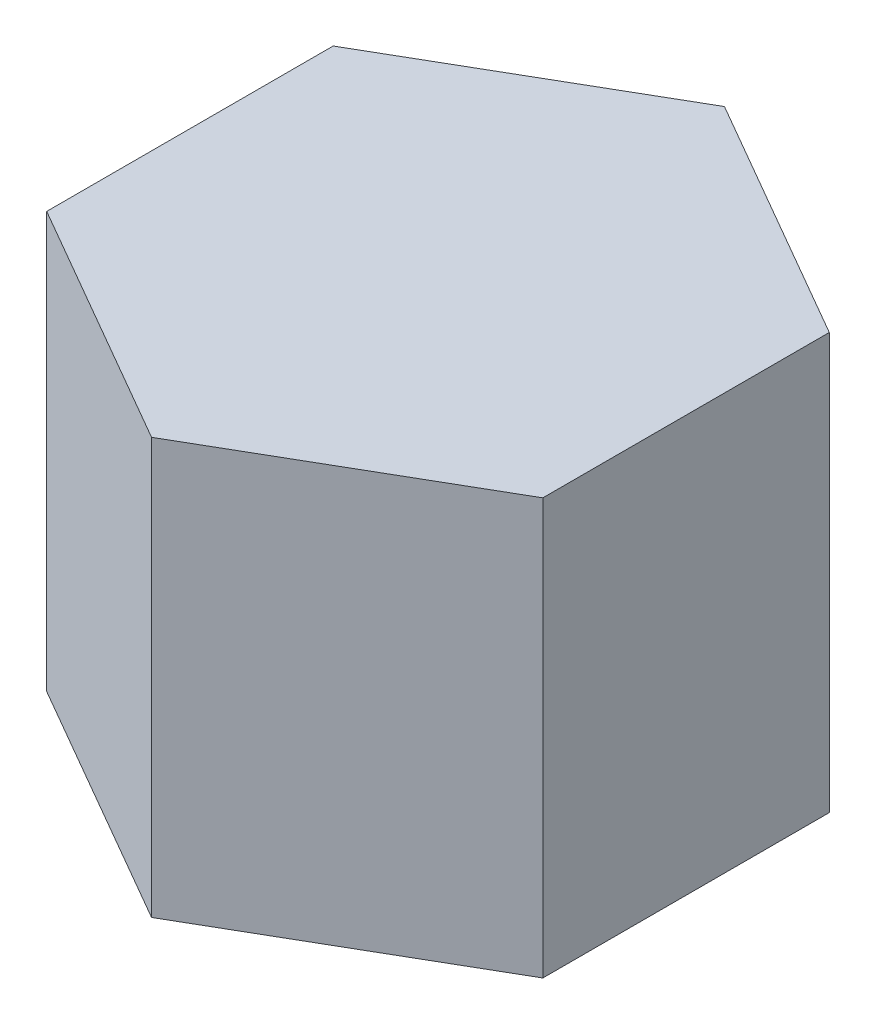
ISO-10303-21;
HEADER;
FILE_DESCRIPTION(('STEP AP214'),'2;1');
FILE_NAME('part.step','',(''),(''),'','','');
FILE_SCHEMA(('AUTOMOTIVE_DESIGN { 1 0 10303 214 1 1 1 1 }'));
ENDSEC;
DATA;
#1=APPLICATION_CONTEXT('core data for automotive mechanical design processes');
#2=APPLICATION_PROTOCOL_DEFINITION('international standard','automotive_design',2000,#1);
#3=PRODUCT_CONTEXT('',#1,'mechanical');
#4=PRODUCT('Part','Part','',(#3));
#5=PRODUCT_RELATED_PRODUCT_CATEGORY('part','',(#4));
#6=PRODUCT_DEFINITION_FORMATION('','',#4);
#7=PRODUCT_DEFINITION_CONTEXT('part definition',#1,'design');
#8=PRODUCT_DEFINITION('design','',#6,#7);
#9=PRODUCT_DEFINITION_SHAPE('','',#8);
#10=(LENGTH_UNIT() NAMED_UNIT(*) SI_UNIT(.MILLI.,.METRE.));
#11=(NAMED_UNIT(*) PLANE_ANGLE_UNIT() SI_UNIT($,.RADIAN.));
#12=(NAMED_UNIT(*) SI_UNIT($,.STERADIAN.) SOLID_ANGLE_UNIT());
#13=UNCERTAINTY_MEASURE_WITH_UNIT(LENGTH_MEASURE(1.E-05),#10,'distance_accuracy_value','');
#14=(GEOMETRIC_REPRESENTATION_CONTEXT(3) GLOBAL_UNCERTAINTY_ASSIGNED_CONTEXT((#13)) GLOBAL_UNIT_ASSIGNED_CONTEXT((#10,
#11,#12)) REPRESENTATION_CONTEXT('',''));
#15=CARTESIAN_POINT('',(0.,0.,0.));
#16=DIRECTION('',(0.,0.,1.));
#17=DIRECTION('',(1.,0.,0.));
#18=AXIS2_PLACEMENT_3D('',#15,#16,#17);
#19=CARTESIAN_POINT('',(202.642660308706,-148.537700895744,288.042869605357));
#20=DIRECTION('',(-0.499999999999943,0.,-0.866025403784472));
#21=DIRECTION('',(-0.866025403784472,0.,0.499999999999943));
#22=AXIS2_PLACEMENT_3D('',#19,#20,#21);
#23=PLANE('',#22);
#24=CARTESIAN_POINT('',(202.339551417382,-149.045793579175,288.217869605357));
#25=DIRECTION('',(0.866025403784471,0.,-0.499999999999943));
#26=VECTOR('',#25,1.);
#27=LINE('',#24,#26);
#28=CARTESIAN_POINT('',(202.339551417382,-149.045793579175,288.217869605357));
#29=VERTEX_POINT('',#28);
#30=CARTESIAN_POINT('',(202.642660308706,-149.045793579175,288.042869605357));
#31=VERTEX_POINT('',#30);
#32=EDGE_CURVE('E170',#29,#31,#27,.T.);
#33=ORIENTED_EDGE('',*,*,#32,.T.);
#34=CARTESIAN_POINT('',(202.642660308706,-148.537700895744,288.042869605357));
#35=DIRECTION('',(0.,-1.,0.));
#36=VECTOR('',#35,1.);
#37=LINE('',#34,#36);
#38=CARTESIAN_POINT('',(202.642660308706,-148.537700895744,288.042869605357));
#39=VERTEX_POINT('',#38);
#40=EDGE_CURVE('E35',#39,#31,#37,.T.);
#41=ORIENTED_EDGE('',*,*,#40,.F.);
#42=CARTESIAN_POINT('',(202.339551417382,-148.537700895744,288.217869605357));
#43=DIRECTION('',(0.866025403784471,0.,-0.499999999999943));
#44=VECTOR('',#43,1.);
#45=LINE('',#42,#44);
#46=CARTESIAN_POINT('',(202.339551417382,-148.537700895744,288.217869605357));
#47=VERTEX_POINT('',#46);
#48=EDGE_CURVE('E159',#47,#39,#45,.T.);
#49=ORIENTED_EDGE('',*,*,#48,.F.);
#50=CARTESIAN_POINT('',(202.339551417382,-148.537700895744,288.217869605357));
#51=DIRECTION('',(0.,-1.,0.));
#52=VECTOR('',#51,1.);
#53=LINE('',#50,#52);
#54=EDGE_CURVE('E10',#47,#29,#53,.T.);
#55=ORIENTED_EDGE('',*,*,#54,.T.);
#56=EDGE_LOOP('',(#33,#41,#49,#55));
#57=FACE_BOUND('',#56,.T.);
#58=ADVANCED_FACE('F16',(#57),#23,.F.);
#59=CARTESIAN_POINT('',(202.339551417382,-148.537700895744,288.217869605357));
#60=DIRECTION('',(0.500000000000062,0.,-0.866025403784403));
#61=DIRECTION('',(-0.866025403784403,0.,-0.500000000000062));
#62=AXIS2_PLACEMENT_3D('',#59,#60,#61);
#63=PLANE('',#62);
#64=CARTESIAN_POINT('',(202.036442526057,-149.045793579175,288.042869605357));
#65=DIRECTION('',(0.866025403784403,0.,0.500000000000062));
#66=VECTOR('',#65,1.);
#67=LINE('',#64,#66);
#68=CARTESIAN_POINT('',(202.036442526057,-149.045793579175,288.042869605357));
#69=VERTEX_POINT('',#68);
#70=EDGE_CURVE('E167',#69,#29,#67,.T.);
#71=ORIENTED_EDGE('',*,*,#70,.T.);
#72=ORIENTED_EDGE('',*,*,#54,.F.);
#73=CARTESIAN_POINT('',(202.036442526057,-148.537700895744,288.042869605357));
#74=DIRECTION('',(0.866025403784403,0.,0.500000000000062));
#75=VECTOR('',#74,1.);
#76=LINE('',#73,#75);
#77=CARTESIAN_POINT('',(202.036442526057,-148.537700895744,288.042869605357));
#78=VERTEX_POINT('',#77);
#79=EDGE_CURVE('E156',#78,#47,#76,.T.);
#80=ORIENTED_EDGE('',*,*,#79,.F.);
#81=CARTESIAN_POINT('',(202.036442526057,-148.537700895744,288.042869605357));
#82=DIRECTION('',(0.,-1.,0.));
#83=VECTOR('',#82,1.);
#84=LINE('',#81,#83);
#85=EDGE_CURVE('E27',#78,#69,#84,.T.);
#86=ORIENTED_EDGE('',*,*,#85,.T.);
#87=EDGE_LOOP('',(#71,#72,#80,#86));
#88=FACE_BOUND('',#87,.T.);
#89=ADVANCED_FACE('F189',(#88),#63,.F.);
#90=CARTESIAN_POINT('',(202.036442526057,-148.537700895744,290.831971220494));
#91=DIRECTION('',(1.,0.,0.));
#92=DIRECTION('',(0.,1.,0.));
#93=AXIS2_PLACEMENT_3D('',#90,#91,#92);
#94=PLANE('',#93);
#95=CARTESIAN_POINT('',(202.036442526057,-149.045793579175,287.692869605357));
#96=DIRECTION('',(0.,0.,1.));
#97=VECTOR('',#96,1.);
#98=LINE('',#95,#97);
#99=CARTESIAN_POINT('',(202.036442526057,-149.045793579175,287.692869605357));
#100=VERTEX_POINT('',#99);
#101=EDGE_CURVE('E163',#100,#69,#98,.T.);
#102=ORIENTED_EDGE('',*,*,#101,.T.);
#103=ORIENTED_EDGE('',*,*,#85,.F.);
#104=CARTESIAN_POINT('',(202.036442526057,-148.537700895744,287.692869605357));
#105=DIRECTION('',(0.,0.,1.));
#106=VECTOR('',#105,1.);
#107=LINE('',#104,#106);
#108=CARTESIAN_POINT('',(202.036442526057,-148.537700895744,287.692869605357));
#109=VERTEX_POINT('',#108);
#110=EDGE_CURVE('E106',#109,#78,#107,.T.);
#111=ORIENTED_EDGE('',*,*,#110,.F.);
#112=CARTESIAN_POINT('',(202.036442526057,-148.537700895744,287.692869605357));
#113=DIRECTION('',(0.,-1.,0.));
#114=VECTOR('',#113,1.);
#115=LINE('',#112,#114);
#116=EDGE_CURVE('E94',#109,#100,#115,.T.);
#117=ORIENTED_EDGE('',*,*,#116,.T.);
#118=EDGE_LOOP('',(#102,#103,#111,#117));
#119=FACE_BOUND('',#118,.T.);
#120=ADVANCED_FACE('F198',(#119),#94,.F.);
#121=CARTESIAN_POINT('',(202.036442526057,-148.537700895744,287.692869605357));
#122=DIRECTION('',(0.499999999999978,0.,0.866025403784452));
#123=DIRECTION('',(0.866025403784452,0.,-0.499999999999978));
#124=AXIS2_PLACEMENT_3D('',#121,#122,#123);
#125=PLANE('',#124);
#126=CARTESIAN_POINT('',(202.339551417382,-149.045793579175,287.517869605357));
#127=DIRECTION('',(-0.866025403784452,0.,0.499999999999978));
#128=VECTOR('',#127,1.);
#129=LINE('',#126,#128);
#130=CARTESIAN_POINT('',(202.339551417382,-149.045793579175,287.517869605357));
#131=VERTEX_POINT('',#130);
#132=EDGE_CURVE('E162',#131,#100,#129,.T.);
#133=ORIENTED_EDGE('',*,*,#132,.T.);
#134=ORIENTED_EDGE('',*,*,#116,.F.);
#135=CARTESIAN_POINT('',(202.339551417382,-148.537700895744,287.517869605357));
#136=DIRECTION('',(-0.866025403784452,0.,0.499999999999978));
#137=VECTOR('',#136,1.);
#138=LINE('',#135,#137);
#139=CARTESIAN_POINT('',(202.339551417382,-148.537700895744,287.517869605357));
#140=VERTEX_POINT('',#139);
#141=EDGE_CURVE('E98',#140,#109,#138,.T.);
#142=ORIENTED_EDGE('',*,*,#141,.F.);
#143=CARTESIAN_POINT('',(202.339551417382,-148.537700895744,287.517869605357));
#144=DIRECTION('',(0.,-1.,0.));
#145=VECTOR('',#144,1.);
#146=LINE('',#143,#145);
#147=EDGE_CURVE('E79',#140,#131,#146,.T.);
#148=ORIENTED_EDGE('',*,*,#147,.T.);
#149=EDGE_LOOP('',(#133,#134,#142,#148));
#150=FACE_BOUND('',#149,.T.);
#151=ADVANCED_FACE('F100',(#150),#125,.F.);
#152=CARTESIAN_POINT('',(202.339551417382,-148.537700895744,287.517869605357));
#153=DIRECTION('',(-0.499999999999978,0.,0.866025403784452));
#154=DIRECTION('',(0.866025403784452,0.,0.499999999999978));
#155=AXIS2_PLACEMENT_3D('',#152,#153,#154);
#156=PLANE('',#155);
#157=CARTESIAN_POINT('',(202.642660308706,-149.045793579175,287.692869605357));
#158=DIRECTION('',(-0.866025403784452,0.,-0.499999999999978));
#159=VECTOR('',#158,1.);
#160=LINE('',#157,#159);
#161=CARTESIAN_POINT('',(202.642660308706,-149.045793579175,287.692869605357));
#162=VERTEX_POINT('',#161);
#163=EDGE_CURVE('E88',#162,#131,#160,.T.);
#164=ORIENTED_EDGE('',*,*,#163,.T.);
#165=ORIENTED_EDGE('',*,*,#147,.F.);
#166=CARTESIAN_POINT('',(202.642660308706,-148.537700895744,287.692869605357));
#167=DIRECTION('',(-0.866025403784452,0.,-0.499999999999978));
#168=VECTOR('',#167,1.);
#169=LINE('',#166,#168);
#170=CARTESIAN_POINT('',(202.642660308706,-148.537700895744,287.692869605357));
#171=VERTEX_POINT('',#170);
#172=EDGE_CURVE('E84',#171,#140,#169,.T.);
#173=ORIENTED_EDGE('',*,*,#172,.F.);
#174=CARTESIAN_POINT('',(202.642660308706,-148.537700895744,287.692869605357));
#175=DIRECTION('',(0.,-1.,0.));
#176=VECTOR('',#175,1.);
#177=LINE('',#174,#176);
#178=EDGE_CURVE('E58',#171,#162,#177,.T.);
#179=ORIENTED_EDGE('',*,*,#178,.T.);
#180=EDGE_LOOP('',(#164,#165,#173,#179));
#181=FACE_BOUND('',#180,.T.);
#182=ADVANCED_FACE('F82',(#181),#156,.F.);
#183=CARTESIAN_POINT('',(202.642660308706,-148.537700895744,290.831971220494));
#184=DIRECTION('',(-1.,0.,0.));
#185=DIRECTION('',(0.,-1.,0.));
#186=AXIS2_PLACEMENT_3D('',#183,#184,#185);
#187=PLANE('',#186);
#188=CARTESIAN_POINT('',(202.642660308706,-149.045793579175,288.042869605357));
#189=DIRECTION('',(0.,0.,-1.));
#190=VECTOR('',#189,1.);
#191=LINE('',#188,#190);
#192=EDGE_CURVE('E160',#31,#162,#191,.T.);
#193=ORIENTED_EDGE('',*,*,#192,.T.);
#194=ORIENTED_EDGE('',*,*,#178,.F.);
#195=CARTESIAN_POINT('',(202.642660308706,-148.537700895744,288.042869605357));
#196=DIRECTION('',(0.,0.,-1.));
#197=VECTOR('',#196,1.);
#198=LINE('',#195,#197);
#199=EDGE_CURVE('E112',#39,#171,#198,.T.);
#200=ORIENTED_EDGE('',*,*,#199,.F.);
#201=ORIENTED_EDGE('',*,*,#40,.T.);
#202=EDGE_LOOP('',(#193,#194,#200,#201));
#203=FACE_BOUND('',#202,.T.);
#204=ADVANCED_FACE('F131',(#203),#187,.F.);
#205=CARTESIAN_POINT('',(206.339551417382,-148.537700895744,290.831971220494));
#206=DIRECTION('',(0.,-1.,0.));
#207=DIRECTION('',(1.,0.,0.));
#208=AXIS2_PLACEMENT_3D('',#205,#206,#207);
#209=PLANE('',#208);
#210=ORIENTED_EDGE('',*,*,#48,.T.);
#211=ORIENTED_EDGE('',*,*,#199,.T.);
#212=ORIENTED_EDGE('',*,*,#172,.T.);
#213=ORIENTED_EDGE('',*,*,#141,.T.);
#214=ORIENTED_EDGE('',*,*,#110,.T.);
#215=ORIENTED_EDGE('',*,*,#79,.T.);
#216=EDGE_LOOP('',(#210,#211,#212,#213,#214,#215));
#217=FACE_BOUND('',#216,.T.);
#218=ADVANCED_FACE('F111',(#217),#209,.F.);
#219=CARTESIAN_POINT('',(206.339551417382,-149.045793579175,290.831971220494));
#220=DIRECTION('',(0.,-1.,0.));
#221=DIRECTION('',(1.,0.,0.));
#222=AXIS2_PLACEMENT_3D('',#219,#220,#221);
#223=PLANE('',#222);
#224=ORIENTED_EDGE('',*,*,#32,.F.);
#225=ORIENTED_EDGE('',*,*,#70,.F.);
#226=ORIENTED_EDGE('',*,*,#101,.F.);
#227=ORIENTED_EDGE('',*,*,#132,.F.);
#228=ORIENTED_EDGE('',*,*,#163,.F.);
#229=ORIENTED_EDGE('',*,*,#192,.F.);
#230=EDGE_LOOP('',(#224,#225,#226,#227,#228,#229));
#231=FACE_BOUND('',#230,.T.);
#232=ADVANCED_FACE('F130',(#231),#223,.T.);
#233=CLOSED_SHELL('',(#58,#89,#120,#151,#182,#204,#218,#232));
#234=MANIFOLD_SOLID_BREP('B1',#233);
#235=ADVANCED_BREP_SHAPE_REPRESENTATION('',(#18,#234),#14);
#236=SHAPE_DEFINITION_REPRESENTATION(#9,#235);
ENDSEC;
END-ISO-10303-21;
